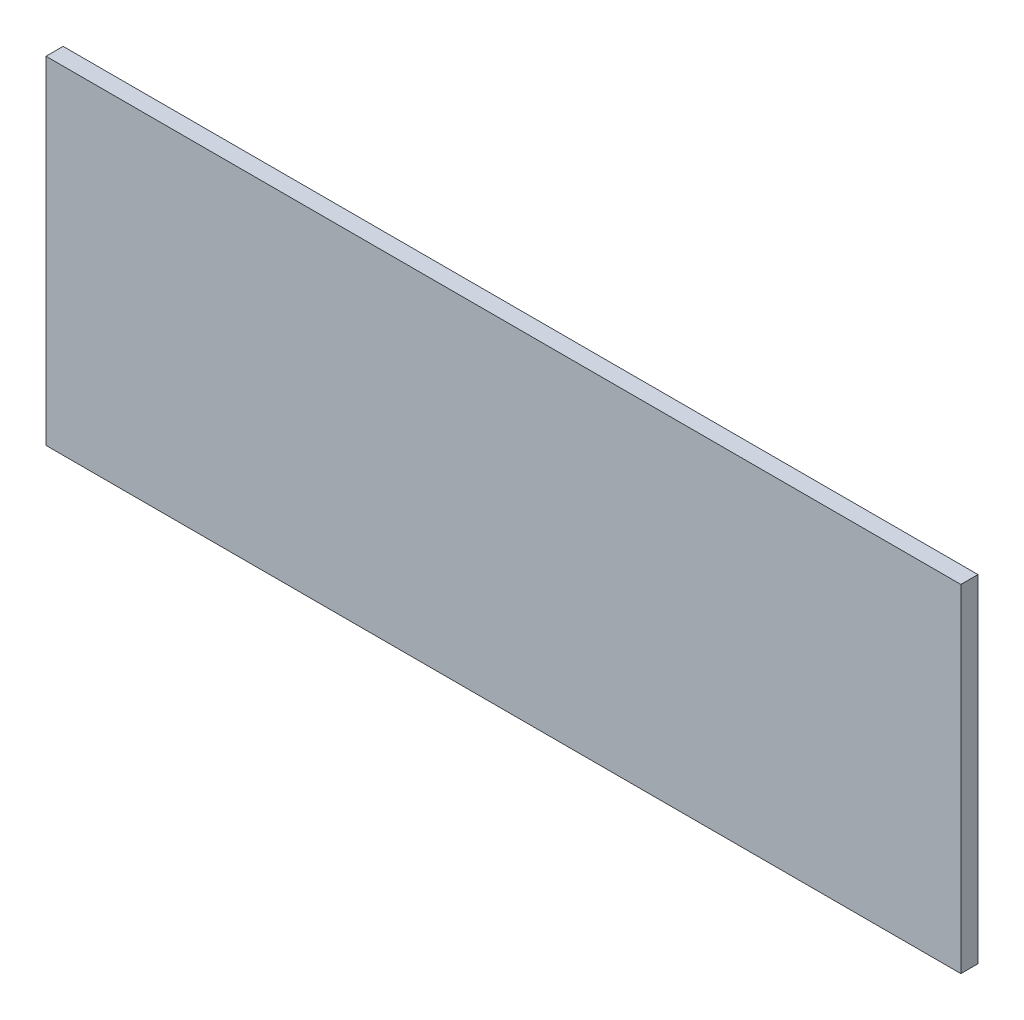
ISO-10303-21;
HEADER;
FILE_DESCRIPTION(('STEP AP214'),'2;1');
FILE_NAME('part.step','',(''),(''),'','','');
FILE_SCHEMA(('AUTOMOTIVE_DESIGN { 1 0 10303 214 1 1 1 1 }'));
ENDSEC;
DATA;
#1=APPLICATION_CONTEXT('core data for automotive mechanical design processes');
#2=APPLICATION_PROTOCOL_DEFINITION('international standard','automotive_design',2000,#1);
#3=PRODUCT_CONTEXT('',#1,'mechanical');
#4=PRODUCT('Part','Part','',(#3));
#5=PRODUCT_RELATED_PRODUCT_CATEGORY('part','',(#4));
#6=PRODUCT_DEFINITION_FORMATION('','',#4);
#7=PRODUCT_DEFINITION_CONTEXT('part definition',#1,'design');
#8=PRODUCT_DEFINITION('design','',#6,#7);
#9=PRODUCT_DEFINITION_SHAPE('','',#8);
#10=(LENGTH_UNIT() NAMED_UNIT(*) SI_UNIT(.MILLI.,.METRE.));
#11=(NAMED_UNIT(*) PLANE_ANGLE_UNIT() SI_UNIT($,.RADIAN.));
#12=(NAMED_UNIT(*) SI_UNIT($,.STERADIAN.) SOLID_ANGLE_UNIT());
#13=UNCERTAINTY_MEASURE_WITH_UNIT(LENGTH_MEASURE(1.E-05),#10,'distance_accuracy_value','');
#14=(GEOMETRIC_REPRESENTATION_CONTEXT(3) GLOBAL_UNCERTAINTY_ASSIGNED_CONTEXT((#13)) GLOBAL_UNIT_ASSIGNED_CONTEXT((#10,
#11,#12)) REPRESENTATION_CONTEXT('',''));
#15=CARTESIAN_POINT('',(0.,0.,0.));
#16=DIRECTION('',(0.,0.,1.));
#17=DIRECTION('',(1.,0.,0.));
#18=AXIS2_PLACEMENT_3D('',#15,#16,#17);
#19=CARTESIAN_POINT('',(81.8669967651367,71.3369979858398,0.));
#20=DIRECTION('',(0.,1.,0.));
#21=DIRECTION('',(1.,0.,0.));
#22=AXIS2_PLACEMENT_3D('',#19,#20,#21);
#23=PLANE('',#22);
#24=DIRECTION('',(1.,0.,0.));
#25=VECTOR('',#24,1.);
#26=CARTESIAN_POINT('',(81.8669967651367,71.3369979858398,0.03556));
#27=LINE('',#26,#25);
#28=CARTESIAN_POINT('',(81.8669967651367,71.3369979858398,0.03556));
#29=VERTEX_POINT('',#28);
#30=CARTESIAN_POINT('',(83.7669982910156,71.3369979858398,0.03556));
#31=VERTEX_POINT('',#30);
#32=EDGE_CURVE('E11',#29,#31,#27,.T.);
#33=ORIENTED_EDGE('',*,*,#32,.F.);
#34=DIRECTION('',(0.,0.,1.));
#35=VECTOR('',#34,1.);
#36=CARTESIAN_POINT('',(81.8669967651367,71.3369979858398,0.));
#37=LINE('',#36,#35);
#38=CARTESIAN_POINT('',(81.8669967651367,71.3369979858398,0.));
#39=VERTEX_POINT('',#38);
#40=EDGE_CURVE('E24',#39,#29,#37,.T.);
#41=ORIENTED_EDGE('',*,*,#40,.F.);
#42=DIRECTION('',(1.,0.,0.));
#43=VECTOR('',#42,1.);
#44=CARTESIAN_POINT('',(81.8669967651367,71.3369979858398,0.));
#45=LINE('',#44,#43);
#46=CARTESIAN_POINT('',(83.7669982910156,71.3369979858398,0.));
#47=VERTEX_POINT('',#46);
#48=EDGE_CURVE('E75',#39,#47,#45,.T.);
#49=ORIENTED_EDGE('',*,*,#48,.T.);
#50=DIRECTION('',(0.,0.,1.));
#51=VECTOR('',#50,1.);
#52=CARTESIAN_POINT('',(83.7669982910156,71.3369979858398,0.));
#53=LINE('',#52,#51);
#54=EDGE_CURVE('E37',#47,#31,#53,.T.);
#55=ORIENTED_EDGE('',*,*,#54,.T.);
#56=EDGE_LOOP('',(#33,#41,#49,#55));
#57=FACE_BOUND('',#56,.T.);
#58=ADVANCED_FACE('F17',(#57),#23,.F.);
#59=CARTESIAN_POINT('',(83.7669982910156,71.3369979858398,0.));
#60=DIRECTION('',(-1.,0.,0.));
#61=DIRECTION('',(0.,1.,0.));
#62=AXIS2_PLACEMENT_3D('',#59,#60,#61);
#63=PLANE('',#62);
#64=DIRECTION('',(0.,1.,0.));
#65=VECTOR('',#64,1.);
#66=CARTESIAN_POINT('',(83.7669982910156,71.3369979858398,0.03556));
#67=LINE('',#66,#65);
#68=CARTESIAN_POINT('',(83.7669982910156,72.0370025634766,0.03556));
#69=VERTEX_POINT('',#68);
#70=EDGE_CURVE('E83',#31,#69,#67,.T.);
#71=ORIENTED_EDGE('',*,*,#70,.F.);
#72=ORIENTED_EDGE('',*,*,#54,.F.);
#73=DIRECTION('',(0.,1.,0.));
#74=VECTOR('',#73,1.);
#75=CARTESIAN_POINT('',(83.7669982910156,71.3369979858398,0.));
#76=LINE('',#75,#74);
#77=CARTESIAN_POINT('',(83.7669982910156,72.0370025634766,0.));
#78=VERTEX_POINT('',#77);
#79=EDGE_CURVE('E81',#47,#78,#76,.T.);
#80=ORIENTED_EDGE('',*,*,#79,.T.);
#81=DIRECTION('',(0.,0.,1.));
#82=VECTOR('',#81,1.);
#83=CARTESIAN_POINT('',(83.7669982910156,72.0370025634766,0.));
#84=LINE('',#83,#82);
#85=EDGE_CURVE('E67',#78,#69,#84,.T.);
#86=ORIENTED_EDGE('',*,*,#85,.T.);
#87=EDGE_LOOP('',(#71,#72,#80,#86));
#88=FACE_BOUND('',#87,.T.);
#89=ADVANCED_FACE('F89',(#88),#63,.F.);
#90=CARTESIAN_POINT('',(83.7669982910156,72.0370025634766,0.));
#91=DIRECTION('',(0.,-1.,0.));
#92=DIRECTION('',(-1.,0.,0.));
#93=AXIS2_PLACEMENT_3D('',#90,#91,#92);
#94=PLANE('',#93);
#95=DIRECTION('',(-1.,0.,0.));
#96=VECTOR('',#95,1.);
#97=CARTESIAN_POINT('',(83.7669982910156,72.0370025634766,0.03556));
#98=LINE('',#97,#96);
#99=CARTESIAN_POINT('',(81.8669967651367,72.0370025634766,0.03556));
#100=VERTEX_POINT('',#99);
#101=EDGE_CURVE('E71',#69,#100,#98,.T.);
#102=ORIENTED_EDGE('',*,*,#101,.F.);
#103=ORIENTED_EDGE('',*,*,#85,.F.);
#104=DIRECTION('',(-1.,0.,0.));
#105=VECTOR('',#104,1.);
#106=CARTESIAN_POINT('',(83.7669982910156,72.0370025634766,0.));
#107=LINE('',#106,#105);
#108=CARTESIAN_POINT('',(81.8669967651367,72.0370025634766,0.));
#109=VERTEX_POINT('',#108);
#110=EDGE_CURVE('E63',#78,#109,#107,.T.);
#111=ORIENTED_EDGE('',*,*,#110,.T.);
#112=DIRECTION('',(0.,0.,1.));
#113=VECTOR('',#112,1.);
#114=CARTESIAN_POINT('',(81.8669967651367,72.0370025634766,0.));
#115=LINE('',#114,#113);
#116=EDGE_CURVE('E53',#109,#100,#115,.T.);
#117=ORIENTED_EDGE('',*,*,#116,.T.);
#118=EDGE_LOOP('',(#102,#103,#111,#117));
#119=FACE_BOUND('',#118,.T.);
#120=ADVANCED_FACE('F66',(#119),#94,.F.);
#121=CARTESIAN_POINT('',(81.8669967651367,72.0370025634766,0.));
#122=DIRECTION('',(1.,0.,0.));
#123=DIRECTION('',(0.,-1.,0.));
#124=AXIS2_PLACEMENT_3D('',#121,#122,#123);
#125=PLANE('',#124);
#126=DIRECTION('',(0.,-1.,0.));
#127=VECTOR('',#126,1.);
#128=CARTESIAN_POINT('',(81.8669967651367,72.0370025634766,0.03556));
#129=LINE('',#128,#127);
#130=EDGE_CURVE('E59',#100,#29,#129,.T.);
#131=ORIENTED_EDGE('',*,*,#130,.F.);
#132=ORIENTED_EDGE('',*,*,#116,.F.);
#133=DIRECTION('',(0.,-1.,0.));
#134=VECTOR('',#133,1.);
#135=CARTESIAN_POINT('',(81.8669967651367,72.0370025634766,0.));
#136=LINE('',#135,#134);
#137=EDGE_CURVE('E57',#109,#39,#136,.T.);
#138=ORIENTED_EDGE('',*,*,#137,.T.);
#139=ORIENTED_EDGE('',*,*,#40,.T.);
#140=EDGE_LOOP('',(#131,#132,#138,#139));
#141=FACE_BOUND('',#140,.T.);
#142=ADVANCED_FACE('F55',(#141),#125,.F.);
#143=CARTESIAN_POINT('',(81.8669967651367,71.3369979858398,0.));
#144=DIRECTION('',(0.,0.,-1.));
#145=DIRECTION('',(-1.,0.,0.));
#146=AXIS2_PLACEMENT_3D('',#143,#144,#145);
#147=PLANE('',#146);
#148=ORIENTED_EDGE('',*,*,#137,.F.);
#149=ORIENTED_EDGE('',*,*,#110,.F.);
#150=ORIENTED_EDGE('',*,*,#79,.F.);
#151=ORIENTED_EDGE('',*,*,#48,.F.);
#152=EDGE_LOOP('',(#148,#149,#150,#151));
#153=FACE_BOUND('',#152,.T.);
#154=ADVANCED_FACE('F74',(#153),#147,.T.);
#155=CARTESIAN_POINT('',(81.8669967651367,71.3369979858398,0.03556));
#156=DIRECTION('',(0.,0.,-1.));
#157=DIRECTION('',(-1.,0.,0.));
#158=AXIS2_PLACEMENT_3D('',#155,#156,#157);
#159=PLANE('',#158);
#160=ORIENTED_EDGE('',*,*,#32,.T.);
#161=ORIENTED_EDGE('',*,*,#70,.T.);
#162=ORIENTED_EDGE('',*,*,#101,.T.);
#163=ORIENTED_EDGE('',*,*,#130,.T.);
#164=EDGE_LOOP('',(#160,#161,#162,#163));
#165=FACE_BOUND('',#164,.T.);
#166=ADVANCED_FACE('F91',(#165),#159,.F.);
#167=CLOSED_SHELL('',(#58,#89,#120,#142,#154,#166));
#168=MANIFOLD_SOLID_BREP('B1',#167);
#169=ADVANCED_BREP_SHAPE_REPRESENTATION('',(#18,#168),#14);
#170=SHAPE_DEFINITION_REPRESENTATION(#9,#169);
ENDSEC;
END-ISO-10303-21;
